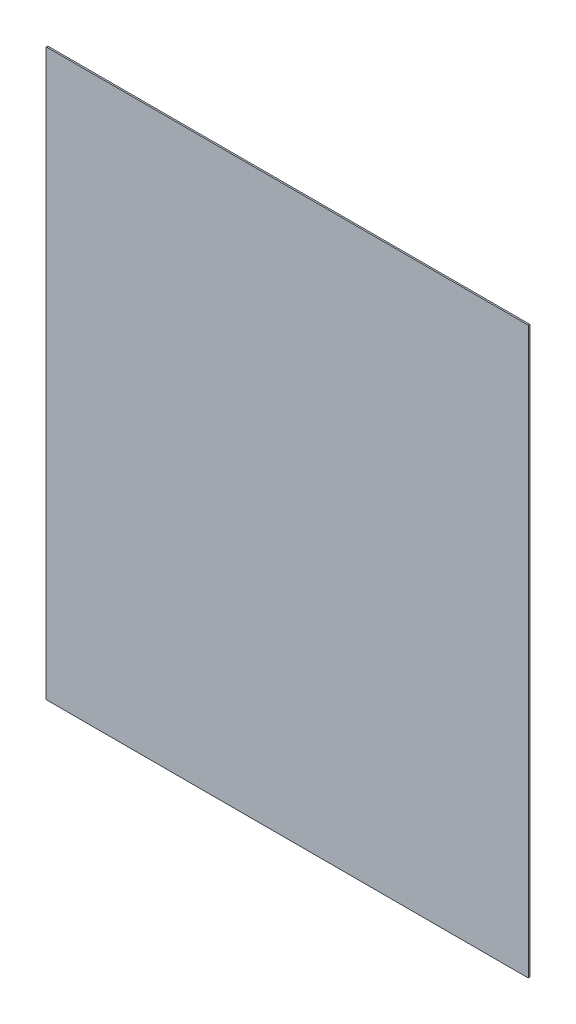
ISO-10303-21;
HEADER;
FILE_DESCRIPTION(('STEP AP214'),'2;1');
FILE_NAME('part.step','',(''),(''),'','','');
FILE_SCHEMA(('AUTOMOTIVE_DESIGN { 1 0 10303 214 1 1 1 1 }'));
ENDSEC;
DATA;
#1=APPLICATION_CONTEXT('core data for automotive mechanical design processes');
#2=APPLICATION_PROTOCOL_DEFINITION('international standard','automotive_design',2000,#1);
#3=PRODUCT_CONTEXT('',#1,'mechanical');
#4=PRODUCT('Part','Part','',(#3));
#5=PRODUCT_RELATED_PRODUCT_CATEGORY('part','',(#4));
#6=PRODUCT_DEFINITION_FORMATION('','',#4);
#7=PRODUCT_DEFINITION_CONTEXT('part definition',#1,'design');
#8=PRODUCT_DEFINITION('design','',#6,#7);
#9=PRODUCT_DEFINITION_SHAPE('','',#8);
#10=(LENGTH_UNIT() NAMED_UNIT(*) SI_UNIT(.MILLI.,.METRE.));
#11=(NAMED_UNIT(*) PLANE_ANGLE_UNIT() SI_UNIT($,.RADIAN.));
#12=(NAMED_UNIT(*) SI_UNIT($,.STERADIAN.) SOLID_ANGLE_UNIT());
#13=UNCERTAINTY_MEASURE_WITH_UNIT(LENGTH_MEASURE(1.E-05),#10,'distance_accuracy_value','');
#14=(GEOMETRIC_REPRESENTATION_CONTEXT(3) GLOBAL_UNCERTAINTY_ASSIGNED_CONTEXT((#13)) GLOBAL_UNIT_ASSIGNED_CONTEXT((#10,
#11,#12)) REPRESENTATION_CONTEXT('',''));
#15=CARTESIAN_POINT('',(0.,0.,0.));
#16=DIRECTION('',(0.,0.,1.));
#17=DIRECTION('',(1.,0.,0.));
#18=AXIS2_PLACEMENT_3D('',#15,#16,#17);
#19=CARTESIAN_POINT('',(0.,0.,1.));
#20=DIRECTION('',(1.,0.,0.));
#21=DIRECTION('',(0.,0.,-1.));
#22=AXIS2_PLACEMENT_3D('',#19,#20,#21);
#23=PLANE('',#22);
#24=DIRECTION('',(0.,-1.,0.));
#25=VECTOR('',#24,1.);
#26=CARTESIAN_POINT('',(0.,0.,0.));
#27=LINE('',#26,#25);
#28=CARTESIAN_POINT('',(0.,380.,0.));
#29=VERTEX_POINT('',#28);
#30=CARTESIAN_POINT('',(0.,0.,0.));
#31=VERTEX_POINT('',#30);
#32=EDGE_CURVE('E107',#29,#31,#27,.T.);
#33=ORIENTED_EDGE('',*,*,#32,.T.);
#34=DIRECTION('',(0.,0.,-1.));
#35=VECTOR('',#34,1.);
#36=CARTESIAN_POINT('',(0.,0.,1.));
#37=LINE('',#36,#35);
#38=CARTESIAN_POINT('',(0.,0.,1.));
#39=VERTEX_POINT('',#38);
#40=EDGE_CURVE('E11',#39,#31,#37,.T.);
#41=ORIENTED_EDGE('',*,*,#40,.F.);
#42=DIRECTION('',(0.,-1.,0.));
#43=VECTOR('',#42,1.);
#44=CARTESIAN_POINT('',(0.,0.,1.));
#45=LINE('',#44,#43);
#46=CARTESIAN_POINT('',(0.,380.,1.));
#47=VERTEX_POINT('',#46);
#48=EDGE_CURVE('E91',#47,#39,#45,.T.);
#49=ORIENTED_EDGE('',*,*,#48,.F.);
#50=DIRECTION('',(0.,0.,-1.));
#51=VECTOR('',#50,1.);
#52=CARTESIAN_POINT('',(0.,380.,1.));
#53=LINE('',#52,#51);
#54=EDGE_CURVE('E103',#47,#29,#53,.T.);
#55=ORIENTED_EDGE('',*,*,#54,.T.);
#56=EDGE_LOOP('',(#33,#41,#49,#55));
#57=FACE_BOUND('',#56,.T.);
#58=ADVANCED_FACE('F39',(#57),#23,.F.);
#59=CARTESIAN_POINT('',(0.,0.,1.));
#60=DIRECTION('',(0.,1.,0.));
#61=DIRECTION('',(0.,0.,1.));
#62=AXIS2_PLACEMENT_3D('',#59,#60,#61);
#63=PLANE('',#62);
#64=DIRECTION('',(1.,0.,0.));
#65=VECTOR('',#64,1.);
#66=CARTESIAN_POINT('',(0.,0.,0.));
#67=LINE('',#66,#65);
#68=CARTESIAN_POINT('',(324.,0.,0.));
#69=VERTEX_POINT('',#68);
#70=EDGE_CURVE('E96',#31,#69,#67,.T.);
#71=ORIENTED_EDGE('',*,*,#70,.T.);
#72=DIRECTION('',(0.,0.,-1.));
#73=VECTOR('',#72,1.);
#74=CARTESIAN_POINT('',(324.,0.,1.));
#75=LINE('',#74,#73);
#76=CARTESIAN_POINT('',(324.,0.,1.));
#77=VERTEX_POINT('',#76);
#78=EDGE_CURVE('E48',#77,#69,#75,.T.);
#79=ORIENTED_EDGE('',*,*,#78,.F.);
#80=DIRECTION('',(1.,0.,0.));
#81=VECTOR('',#80,1.);
#82=CARTESIAN_POINT('',(0.,0.,1.));
#83=LINE('',#82,#81);
#84=EDGE_CURVE('E86',#39,#77,#83,.T.);
#85=ORIENTED_EDGE('',*,*,#84,.F.);
#86=ORIENTED_EDGE('',*,*,#40,.T.);
#87=EDGE_LOOP('',(#71,#79,#85,#86));
#88=FACE_BOUND('',#87,.T.);
#89=ADVANCED_FACE('F95',(#88),#63,.F.);
#90=CARTESIAN_POINT('',(324.,0.,1.));
#91=DIRECTION('',(-1.,0.,0.));
#92=DIRECTION('',(0.,0.,1.));
#93=AXIS2_PLACEMENT_3D('',#90,#91,#92);
#94=PLANE('',#93);
#95=DIRECTION('',(0.,1.,0.));
#96=VECTOR('',#95,1.);
#97=CARTESIAN_POINT('',(324.,0.,0.));
#98=LINE('',#97,#96);
#99=CARTESIAN_POINT('',(324.,380.,0.));
#100=VERTEX_POINT('',#99);
#101=EDGE_CURVE('E73',#69,#100,#98,.T.);
#102=ORIENTED_EDGE('',*,*,#101,.T.);
#103=DIRECTION('',(0.,0.,-1.));
#104=VECTOR('',#103,1.);
#105=CARTESIAN_POINT('',(324.,380.,1.));
#106=LINE('',#105,#104);
#107=CARTESIAN_POINT('',(324.,380.,1.));
#108=VERTEX_POINT('',#107);
#109=EDGE_CURVE('E98',#108,#100,#106,.T.);
#110=ORIENTED_EDGE('',*,*,#109,.F.);
#111=DIRECTION('',(0.,1.,0.));
#112=VECTOR('',#111,1.);
#113=CARTESIAN_POINT('',(324.,0.,1.));
#114=LINE('',#113,#112);
#115=EDGE_CURVE('E89',#77,#108,#114,.T.);
#116=ORIENTED_EDGE('',*,*,#115,.F.);
#117=ORIENTED_EDGE('',*,*,#78,.T.);
#118=EDGE_LOOP('',(#102,#110,#116,#117));
#119=FACE_BOUND('',#118,.T.);
#120=ADVANCED_FACE('F99',(#119),#94,.F.);
#121=CARTESIAN_POINT('',(0.,380.,1.));
#122=DIRECTION('',(0.,-1.,0.));
#123=DIRECTION('',(0.,0.,-1.));
#124=AXIS2_PLACEMENT_3D('',#121,#122,#123);
#125=PLANE('',#124);
#126=DIRECTION('',(-1.,0.,0.));
#127=VECTOR('',#126,1.);
#128=CARTESIAN_POINT('',(0.,380.,0.));
#129=LINE('',#128,#127);
#130=EDGE_CURVE('E79',#100,#29,#129,.T.);
#131=ORIENTED_EDGE('',*,*,#130,.T.);
#132=ORIENTED_EDGE('',*,*,#54,.F.);
#133=DIRECTION('',(-1.,0.,0.));
#134=VECTOR('',#133,1.);
#135=CARTESIAN_POINT('',(0.,380.,1.));
#136=LINE('',#135,#134);
#137=EDGE_CURVE('E56',#108,#47,#136,.T.);
#138=ORIENTED_EDGE('',*,*,#137,.F.);
#139=ORIENTED_EDGE('',*,*,#109,.T.);
#140=EDGE_LOOP('',(#131,#132,#138,#139));
#141=FACE_BOUND('',#140,.T.);
#142=ADVANCED_FACE('F120',(#141),#125,.F.);
#143=CARTESIAN_POINT('',(0.,0.,1.));
#144=DIRECTION('',(0.,0.,-1.));
#145=DIRECTION('',(-1.,0.,0.));
#146=AXIS2_PLACEMENT_3D('',#143,#144,#145);
#147=PLANE('',#146);
#148=ORIENTED_EDGE('',*,*,#48,.T.);
#149=ORIENTED_EDGE('',*,*,#84,.T.);
#150=ORIENTED_EDGE('',*,*,#115,.T.);
#151=ORIENTED_EDGE('',*,*,#137,.T.);
#152=EDGE_LOOP('',(#148,#149,#150,#151));
#153=FACE_BOUND('',#152,.T.);
#154=ADVANCED_FACE('F87',(#153),#147,.F.);
#155=CARTESIAN_POINT('',(0.,0.,0.));
#156=DIRECTION('',(0.,0.,-1.));
#157=DIRECTION('',(-1.,0.,0.));
#158=AXIS2_PLACEMENT_3D('',#155,#156,#157);
#159=PLANE('',#158);
#160=ORIENTED_EDGE('',*,*,#32,.F.);
#161=ORIENTED_EDGE('',*,*,#130,.F.);
#162=ORIENTED_EDGE('',*,*,#101,.F.);
#163=ORIENTED_EDGE('',*,*,#70,.F.);
#164=EDGE_LOOP('',(#160,#161,#162,#163));
#165=FACE_BOUND('',#164,.T.);
#166=ADVANCED_FACE('F123',(#165),#159,.T.);
#167=CLOSED_SHELL('',(#58,#89,#120,#142,#154,#166));
#168=MANIFOLD_SOLID_BREP('B2',#167);
#169=ADVANCED_BREP_SHAPE_REPRESENTATION('',(#18,#168),#14);
#170=SHAPE_DEFINITION_REPRESENTATION(#9,#169);
ENDSEC;
END-ISO-10303-21;
